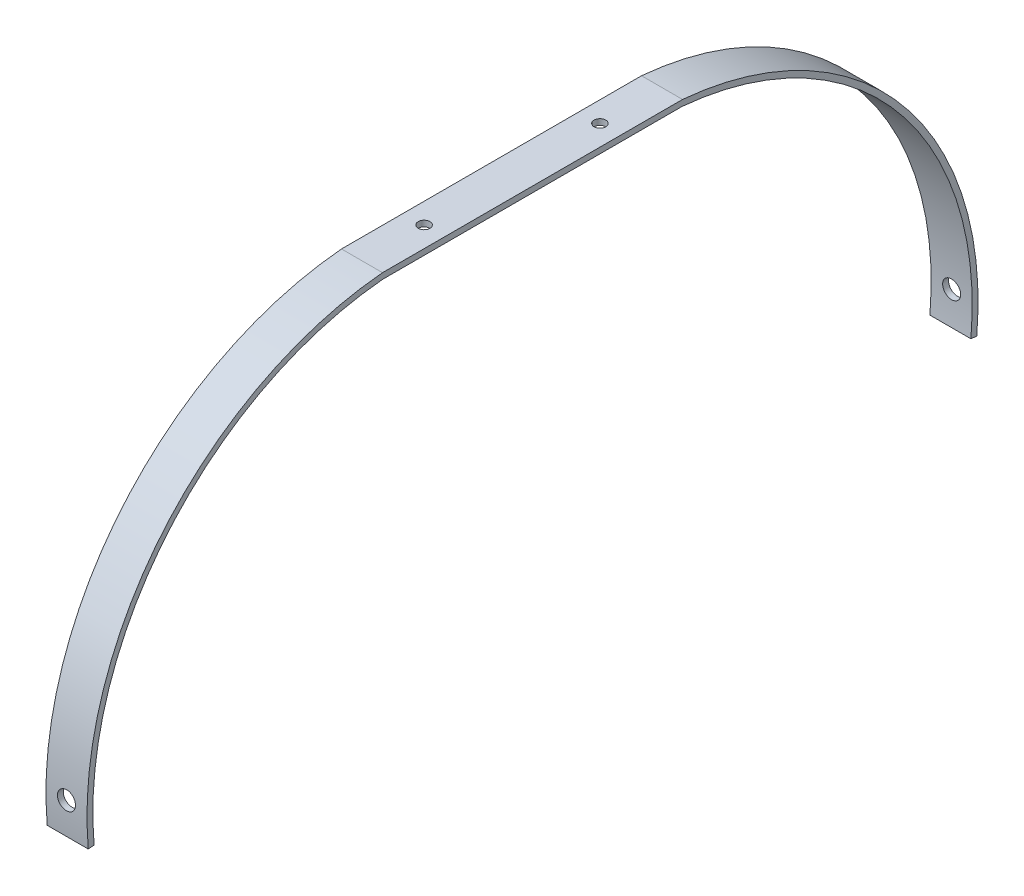
ISO-10303-21;
HEADER;
FILE_DESCRIPTION(('STEP AP214'),'2;1');
FILE_NAME('part.step','',(''),(''),'','','');
FILE_SCHEMA(('AUTOMOTIVE_DESIGN { 1 0 10303 214 1 1 1 1 }'));
ENDSEC;
DATA;
#1=APPLICATION_CONTEXT('core data for automotive mechanical design processes');
#2=APPLICATION_PROTOCOL_DEFINITION('international standard','automotive_design',2000,#1);
#3=PRODUCT_CONTEXT('',#1,'mechanical');
#4=PRODUCT('Part','Part','',(#3));
#5=PRODUCT_RELATED_PRODUCT_CATEGORY('part','',(#4));
#6=PRODUCT_DEFINITION_FORMATION('','',#4);
#7=PRODUCT_DEFINITION_CONTEXT('part definition',#1,'design');
#8=PRODUCT_DEFINITION('design','',#6,#7);
#9=PRODUCT_DEFINITION_SHAPE('','',#8);
#10=(LENGTH_UNIT() NAMED_UNIT(*) SI_UNIT(.MILLI.,.METRE.));
#11=(NAMED_UNIT(*) PLANE_ANGLE_UNIT() SI_UNIT($,.RADIAN.));
#12=(NAMED_UNIT(*) SI_UNIT($,.STERADIAN.) SOLID_ANGLE_UNIT());
#13=UNCERTAINTY_MEASURE_WITH_UNIT(LENGTH_MEASURE(1.E-05),#10,'distance_accuracy_value','');
#14=(GEOMETRIC_REPRESENTATION_CONTEXT(3) GLOBAL_UNCERTAINTY_ASSIGNED_CONTEXT((#13)) GLOBAL_UNIT_ASSIGNED_CONTEXT((#10,
#11,#12)) REPRESENTATION_CONTEXT('',''));
#15=CARTESIAN_POINT('',(0.,0.,0.));
#16=DIRECTION('',(0.,0.,1.));
#17=DIRECTION('',(1.,0.,0.));
#18=AXIS2_PLACEMENT_3D('',#15,#16,#17);
#19=CARTESIAN_POINT('',(17.78,-138.75,52.48));
#20=DIRECTION('',(-1.,0.,0.));
#21=DIRECTION('',(0.,0.,1.));
#22=AXIS2_PLACEMENT_3D('',#19,#20,#21);
#23=CYLINDRICAL_SURFACE('',#22,138.03862853222);
#24=CARTESIAN_POINT('',(12.804165929384,-137.16,190.509471009116));
#25=CARTESIAN_POINT('',(12.8041562065637,-137.379778837389,190.512001955785));
#26=CARTESIAN_POINT('',(12.7855931168543,-137.599721736816,190.514005669718));
#27=CARTESIAN_POINT('',(12.7117945241355,-138.033559604602,190.516940338744));
#28=CARTESIAN_POINT('',(12.6565153214002,-138.247447049059,190.517870011891));
#29=CARTESIAN_POINT('',(12.5108567516558,-138.662825827877,190.518757195393));
#30=CARTESIAN_POINT('',(12.4204941428394,-138.8643230275,190.518715169337));
#31=CARTESIAN_POINT('',(12.2072563901937,-139.249236294209,190.517860101291));
#32=CARTESIAN_POINT('',(12.084389193013,-139.43265676563,190.517047247626));
#33=CARTESIAN_POINT('',(11.8095901146757,-139.776314160567,190.514920338043));
#34=CARTESIAN_POINT('',(11.6576521405216,-139.936546211592,190.513606176998));
#35=CARTESIAN_POINT('',(11.3290323743908,-140.229239967642,190.510780248229));
#36=CARTESIAN_POINT('',(11.1523495962043,-140.361700565304,190.50926847263));
#37=CARTESIAN_POINT('',(10.7792170207906,-140.595111494538,190.506346066599));
#38=CARTESIAN_POINT('',(10.5827630583147,-140.696055167903,190.504935457587));
#39=CARTESIAN_POINT('',(10.1756949159369,-140.863528230789,190.502472881831));
#40=CARTESIAN_POINT('',(9.96508076878997,-140.930057699913,190.501420914257));
#41=CARTESIAN_POINT('',(9.53567607933015,-141.026811787035,190.499858938232));
#42=CARTESIAN_POINT('',(9.31688575389829,-141.057037367325,190.499348915416));
#43=CARTESIAN_POINT('',(8.87733599243423,-141.080327920025,190.498957686211));
#44=CARTESIAN_POINT('',(8.65657656142105,-141.073392987127,190.499076478219));
#45=CARTESIAN_POINT('',(8.21938273618705,-141.022562909102,190.499922682459));
#46=CARTESIAN_POINT('',(8.00294782779847,-140.978672184957,190.500650021891));
#47=CARTESIAN_POINT('',(7.58051848156696,-140.855182979798,190.502588561675));
#48=CARTESIAN_POINT('',(7.37452406200668,-140.775584436257,190.503799762874));
#49=CARTESIAN_POINT('',(6.97880821800266,-140.582933023265,190.50649223341));
#50=CARTESIAN_POINT('',(6.78908785364217,-140.469877976607,190.507973520322));
#51=CARTESIAN_POINT('',(6.43131798003344,-140.213523686767,190.510929292327));
#52=CARTESIAN_POINT('',(6.26326848077982,-140.070224429637,190.512403777418));
#53=CARTESIAN_POINT('',(5.95359249036027,-139.757430591976,190.515040681927));
#54=CARTESIAN_POINT('',(5.8119687889564,-139.587933249173,190.516203068403));
#55=CARTESIAN_POINT('',(5.55918764780873,-139.227564929337,190.517919827591));
#56=CARTESIAN_POINT('',(5.44803017639788,-139.036693974521,190.518474200935));
#57=CARTESIAN_POINT('',(5.25935271355084,-138.639027543524,190.51872694068));
#58=CARTESIAN_POINT('',(5.18182776938136,-138.432234417331,190.518425433168));
#59=CARTESIAN_POINT('',(5.06259280947383,-138.008572617414,190.516799783607));
#60=CARTESIAN_POINT('',(5.02088272271768,-137.79170396367,190.515475643587));
#61=CARTESIAN_POINT('',(4.97446428360646,-137.354103193993,190.511743787287));
#62=CARTESIAN_POINT('',(4.96974726153675,-137.133371995441,190.509336325036));
#63=CARTESIAN_POINT('',(4.99742000042755,-136.694261983716,190.503494843265));
#64=CARTESIAN_POINT('',(5.02980979095735,-136.475883172418,190.500060822928));
#65=CARTESIAN_POINT('',(5.13077706248227,-136.047641669385,190.492340469444));
#66=CARTESIAN_POINT('',(5.19935962476699,-135.837780177897,190.488054016672));
#67=CARTESIAN_POINT('',(5.37076441846223,-135.432552892915,190.478908066149));
#68=CARTESIAN_POINT('',(5.47358676442857,-135.237187147923,190.47404856648));
#69=CARTESIAN_POINT('',(5.71061277148048,-134.866393050816,190.464111515815));
#70=CARTESIAN_POINT('',(5.84483182392033,-134.690974540156,190.459033858873));
#71=CARTESIAN_POINT('',(6.14081913576395,-134.365158165735,190.449064473726));
#72=CARTESIAN_POINT('',(6.30258745359432,-134.21476035504,190.444172745915));
#73=CARTESIAN_POINT('',(6.64912387978107,-133.943226317767,190.434979643409));
#74=CARTESIAN_POINT('',(6.8338964850176,-133.822095826019,190.430678384487));
#75=CARTESIAN_POINT('',(7.22117550255614,-133.61257985386,190.423035053519));
#76=CARTESIAN_POINT('',(7.42368184264433,-133.524194240115,190.419692977569));
#77=CARTESIAN_POINT('',(7.84057563117651,-133.382721432518,190.414260908303));
#78=CARTESIAN_POINT('',(8.05495720473448,-133.329616950481,190.412170301801));
#79=CARTESIAN_POINT('',(8.48960201123869,-133.260152408705,190.409423138942));
#80=CARTESIAN_POINT('',(8.70986522875954,-133.243792252608,190.408766578824));
#81=CARTESIAN_POINT('',(9.14986678811167,-133.24828193548,190.408945725086));
#82=CARTESIAN_POINT('',(9.36960537899232,-133.269107447561,190.409780455862));
#83=CARTESIAN_POINT('',(9.80246437928202,-133.347327048135,190.412866291034));
#84=CARTESIAN_POINT('',(10.0155847777466,-133.4047211971,190.415117397772));
#85=CARTESIAN_POINT('',(10.4291645658046,-133.554443889178,190.420837820413));
#86=CARTESIAN_POINT('',(10.6296237631951,-133.64677296247,190.424307154805));
#87=CARTESIAN_POINT('',(11.0121923382072,-133.863736888478,190.432162476238));
#88=CARTESIAN_POINT('',(11.1943023552549,-133.98837061491,190.43654843132));
#89=CARTESIAN_POINT('',(11.5351215201947,-134.266484456134,190.445866684622));
#90=CARTESIAN_POINT('',(11.6938178548575,-134.419980262079,190.450799279425));
#91=CARTESIAN_POINT('',(11.9832350866285,-134.751471758587,190.46080364535));
#92=CARTESIAN_POINT('',(12.1139489877694,-134.929473557727,190.465875450921));
#93=CARTESIAN_POINT('',(12.3437552696411,-135.305058827823,190.475763156718));
#94=CARTESIAN_POINT('',(12.442816884766,-135.502661107256,190.480578804197));
#95=CARTESIAN_POINT('',(12.6062401222461,-135.911553265103,190.489593258251));
#96=CARTESIAN_POINT('',(12.6706430986031,-136.12282649275,190.493792795582));
#97=CARTESIAN_POINT('',(12.7458592887294,-136.472860985372,190.499911417307));
#98=CARTESIAN_POINT('',(12.7676963959981,-136.609347255174,190.502097555673));
#99=CARTESIAN_POINT('',(12.7968527704833,-136.883867424663,190.50608218769));
#100=CARTESIAN_POINT('',(12.8041720387466,-137.021901324237,190.507880681368));
#101=CARTESIAN_POINT('',(12.804165929384,-137.16,190.509471009116));
#102=B_SPLINE_CURVE_WITH_KNOTS('',3,(#24,#25,#26,#27,#28,#29,#30,#31,#32,#33,#34,#35,#36,#37,
#38,#39,#40,#41,#42,#43,#44,#45,#46,#47,#48,#49,#50,#51,#52,#53,#54,#55,#56,#57,#58,#59,#60,#61,
#62,#63,#64,#65,#66,#67,#68,#69,#70,#71,#72,#73,#74,#75,#76,#77,#78,#79,#80,#81,#82,#83,#84,#85,
#86,#87,#88,#89,#90,#91,#92,#93,#94,#95,#96,#97,#98,#99,#100,#101),.UNSPECIFIED.,.T.,.F.,(4,2,2,
2,2,2,2,2,2,2,2,2,2,2,2,2,2,2,2,2,2,2,2,2,2,2,2,2,2,2,2,2,2,2,2,2,2,2,4),(0.,0.658876303413915,
1.31853821376157,1.97788541214516,2.63707156353566,3.29639602660568,3.95574677468526,
4.61523672190497,5.27472514365692,5.93419608423841,6.59366534438694,7.2530557241175,
7.91244725848575,8.57188171269995,9.23131647104483,9.89082080634323,10.5503244561408,
11.2097309542938,11.8691361448917,12.528386792313,13.1876379650718,13.8469817181306,
14.5063276771736,15.1659975419634,15.8256688058011,16.4854692253045,17.145266958149,
17.8047411431561,18.4642135987745,19.1232547851284,19.782297061278,20.4413493395868,
21.1003786435116,21.7597672765886,22.419320573243,23.0795130105071,23.7389159627899,
24.1529228464133,24.566929700185),.UNSPECIFIED.);
#103=CARTESIAN_POINT('',(12.804165929384,-137.16,190.509471009116));
#104=VERTEX_POINT('',#103);
#105=EDGE_CURVE('E148',#104,#104,#102,.T.);
#106=ORIENTED_EDGE('',*,*,#105,.F.);
#107=EDGE_LOOP('',(#106));
#108=FACE_BOUND('',#107,.T.);
#109=CARTESIAN_POINT('',(0.,-138.75,52.48));
#110=DIRECTION('',(1.,0.,0.));
#111=DIRECTION('',(0.,0.,-1.));
#112=AXIS2_PLACEMENT_3D('',#109,#110,#111);
#113=CIRCLE('',#112,138.03862853222);
#114=CARTESIAN_POINT('',(0.,-1.27,64.8861503721467));
#115=VERTEX_POINT('',#114);
#116=CARTESIAN_POINT('',(0.,-151.043786383236,189.970093401014));
#117=VERTEX_POINT('',#116);
#118=EDGE_CURVE('E145',#115,#117,#113,.T.);
#119=ORIENTED_EDGE('',*,*,#118,.F.);
#120=DIRECTION('',(-1.,0.,0.));
#121=VECTOR('',#120,1.);
#122=CARTESIAN_POINT('',(17.78,-1.27,64.8861503721467));
#123=LINE('',#122,#121);
#124=CARTESIAN_POINT('',(17.78,-1.27,64.8861503721467));
#125=VERTEX_POINT('',#124);
#126=EDGE_CURVE('E57',#125,#115,#123,.T.);
#127=ORIENTED_EDGE('',*,*,#126,.F.);
#128=CARTESIAN_POINT('',(17.78,-138.75,52.48));
#129=DIRECTION('',(1.,0.,0.));
#130=DIRECTION('',(0.,0.,-1.));
#131=AXIS2_PLACEMENT_3D('',#128,#129,#130);
#132=CIRCLE('',#131,138.03862853222);
#133=CARTESIAN_POINT('',(17.78,-151.043786383236,189.970093401014));
#134=VERTEX_POINT('',#133);
#135=EDGE_CURVE('E164',#125,#134,#132,.T.);
#136=ORIENTED_EDGE('',*,*,#135,.T.);
#137=DIRECTION('',(-1.,0.,0.));
#138=VECTOR('',#137,1.);
#139=CARTESIAN_POINT('',(17.78,-151.043786383236,189.970093401014));
#140=LINE('',#139,#138);
#141=EDGE_CURVE('E65',#134,#117,#140,.T.);
#142=ORIENTED_EDGE('',*,*,#141,.T.);
#143=EDGE_LOOP('',(#119,#127,#136,#142));
#144=FACE_BOUND('',#143,.T.);
#145=ADVANCED_FACE('F43',(#108,#144),#23,.F.);
#146=CARTESIAN_POINT('',(17.78,-1.27,0.));
#147=DIRECTION('',(0.,1.,0.));
#148=DIRECTION('',(0.,0.,1.));
#149=AXIS2_PLACEMENT_3D('',#146,#147,#148);
#150=PLANE('',#149);
#151=CARTESIAN_POINT('',(8.89,-1.27,-38.1));
#152=DIRECTION('',(0.,1.,0.));
#153=DIRECTION('',(0.,0.,1.));
#154=AXIS2_PLACEMENT_3D('',#151,#152,#153);
#155=CIRCLE('',#154,2.54);
#156=CARTESIAN_POINT('',(8.89,-1.27,-35.56));
#157=VERTEX_POINT('',#156);
#158=EDGE_CURVE('E230',#157,#157,#155,.T.);
#159=ORIENTED_EDGE('',*,*,#158,.T.);
#160=EDGE_LOOP('',(#159));
#161=FACE_BOUND('',#160,.T.);
#162=CARTESIAN_POINT('',(8.89000000000001,-1.27,38.1));
#163=DIRECTION('',(0.,1.,0.));
#164=DIRECTION('',(0.,0.,1.));
#165=AXIS2_PLACEMENT_3D('',#162,#163,#164);
#166=CIRCLE('',#165,2.54);
#167=CARTESIAN_POINT('',(8.89000000000001,-1.27,40.64));
#168=VERTEX_POINT('',#167);
#169=EDGE_CURVE('E398',#168,#168,#166,.T.);
#170=ORIENTED_EDGE('',*,*,#169,.T.);
#171=EDGE_LOOP('',(#170));
#172=FACE_BOUND('',#171,.T.);
#173=DIRECTION('',(0.,0.,-1.));
#174=VECTOR('',#173,1.);
#175=CARTESIAN_POINT('',(0.,-1.27,0.));
#176=LINE('',#175,#174);
#177=CARTESIAN_POINT('',(0.,-1.27,-64.8861503721467));
#178=VERTEX_POINT('',#177);
#179=EDGE_CURVE('E147',#115,#178,#176,.T.);
#180=ORIENTED_EDGE('',*,*,#179,.T.);
#181=DIRECTION('',(-1.,0.,0.));
#182=VECTOR('',#181,1.);
#183=CARTESIAN_POINT('',(17.78,-1.27,-64.8861503721467));
#184=LINE('',#183,#182);
#185=CARTESIAN_POINT('',(17.78,-1.27,-64.8861503721467));
#186=VERTEX_POINT('',#185);
#187=EDGE_CURVE('E173',#186,#178,#184,.T.);
#188=ORIENTED_EDGE('',*,*,#187,.F.);
#189=DIRECTION('',(0.,0.,-1.));
#190=VECTOR('',#189,1.);
#191=CARTESIAN_POINT('',(17.78,-1.27,0.));
#192=LINE('',#191,#190);
#193=EDGE_CURVE('E179',#125,#186,#192,.T.);
#194=ORIENTED_EDGE('',*,*,#193,.F.);
#195=ORIENTED_EDGE('',*,*,#126,.T.);
#196=EDGE_LOOP('',(#180,#188,#194,#195));
#197=FACE_BOUND('',#196,.T.);
#198=ADVANCED_FACE('F177',(#161,#172,#197),#150,.F.);
#199=CARTESIAN_POINT('',(17.78,-138.75,-52.48));
#200=DIRECTION('',(-1.,0.,0.));
#201=DIRECTION('',(0.,0.,1.));
#202=AXIS2_PLACEMENT_3D('',#199,#200,#201);
#203=CYLINDRICAL_SURFACE('',#202,138.03862853222);
#204=CARTESIAN_POINT('',(12.804165929384,-137.16,-190.509471009116));
#205=CARTESIAN_POINT('',(12.8041562065637,-137.379778837389,-190.512001955785));
#206=CARTESIAN_POINT('',(12.7855931168543,-137.599721736816,-190.514005669718));
#207=CARTESIAN_POINT('',(12.7117945241355,-138.033559604602,-190.516940338744));
#208=CARTESIAN_POINT('',(12.6565153214002,-138.247447049059,-190.517870011891));
#209=CARTESIAN_POINT('',(12.5108567516558,-138.662825827877,-190.518757195393));
#210=CARTESIAN_POINT('',(12.4204941428394,-138.8643230275,-190.518715169337));
#211=CARTESIAN_POINT('',(12.2072563901937,-139.249236294209,-190.517860101291));
#212=CARTESIAN_POINT('',(12.084389193013,-139.43265676563,-190.517047247626));
#213=CARTESIAN_POINT('',(11.8095901146757,-139.776314160567,-190.514920338043));
#214=CARTESIAN_POINT('',(11.6576521405216,-139.936546211592,-190.513606176998));
#215=CARTESIAN_POINT('',(11.3290323743908,-140.229239967642,-190.510780248229));
#216=CARTESIAN_POINT('',(11.1523495962043,-140.361700565304,-190.50926847263));
#217=CARTESIAN_POINT('',(10.7792170207906,-140.595111494538,-190.506346066599));
#218=CARTESIAN_POINT('',(10.5827630583147,-140.696055167903,-190.504935457587));
#219=CARTESIAN_POINT('',(10.1756949159369,-140.863528230789,-190.502472881831));
#220=CARTESIAN_POINT('',(9.96508076878997,-140.930057699913,-190.501420914257));
#221=CARTESIAN_POINT('',(9.53567607933015,-141.026811787035,-190.499858938232));
#222=CARTESIAN_POINT('',(9.31688575389829,-141.057037367325,-190.499348915416));
#223=CARTESIAN_POINT('',(8.87733599243423,-141.080327920025,-190.498957686211));
#224=CARTESIAN_POINT('',(8.65657656142105,-141.073392987127,-190.499076478219));
#225=CARTESIAN_POINT('',(8.21938273618705,-141.022562909102,-190.499922682459));
#226=CARTESIAN_POINT('',(8.00294782779847,-140.978672184957,-190.500650021891));
#227=CARTESIAN_POINT('',(7.58051848156696,-140.855182979798,-190.502588561675));
#228=CARTESIAN_POINT('',(7.37452406200668,-140.775584436257,-190.503799762874));
#229=CARTESIAN_POINT('',(6.97880821800266,-140.582933023265,-190.50649223341));
#230=CARTESIAN_POINT('',(6.78908785364217,-140.469877976607,-190.507973520322));
#231=CARTESIAN_POINT('',(6.43131798003344,-140.213523686767,-190.510929292327));
#232=CARTESIAN_POINT('',(6.26326848077982,-140.070224429637,-190.512403777418));
#233=CARTESIAN_POINT('',(5.95359249036027,-139.757430591976,-190.515040681927));
#234=CARTESIAN_POINT('',(5.8119687889564,-139.587933249173,-190.516203068403));
#235=CARTESIAN_POINT('',(5.55918764780873,-139.227564929337,-190.517919827591));
#236=CARTESIAN_POINT('',(5.44803017639788,-139.036693974521,-190.518474200935));
#237=CARTESIAN_POINT('',(5.25935271355084,-138.639027543524,-190.51872694068));
#238=CARTESIAN_POINT('',(5.18182776938136,-138.432234417331,-190.518425433168));
#239=CARTESIAN_POINT('',(5.06259280947383,-138.008572617414,-190.516799783607));
#240=CARTESIAN_POINT('',(5.02088272271768,-137.79170396367,-190.515475643587));
#241=CARTESIAN_POINT('',(4.97446428360646,-137.354103193993,-190.511743787287));
#242=CARTESIAN_POINT('',(4.96974726153675,-137.133371995441,-190.509336325036));
#243=CARTESIAN_POINT('',(4.99742000042755,-136.694261983716,-190.503494843265));
#244=CARTESIAN_POINT('',(5.02980979095735,-136.475883172418,-190.500060822928));
#245=CARTESIAN_POINT('',(5.13077706248227,-136.047641669385,-190.492340469444));
#246=CARTESIAN_POINT('',(5.19935962476699,-135.837780177897,-190.488054016672));
#247=CARTESIAN_POINT('',(5.37076441846224,-135.432552892915,-190.478908066149));
#248=CARTESIAN_POINT('',(5.47358676442858,-135.237187147923,-190.47404856648));
#249=CARTESIAN_POINT('',(5.71061277148049,-134.866393050816,-190.464111515815));
#250=CARTESIAN_POINT('',(5.84483182392034,-134.690974540156,-190.459033858873));
#251=CARTESIAN_POINT('',(6.14081913576396,-134.365158165735,-190.449064473726));
#252=CARTESIAN_POINT('',(6.30258745359432,-134.21476035504,-190.444172745915));
#253=CARTESIAN_POINT('',(6.64912387978107,-133.943226317767,-190.434979643409));
#254=CARTESIAN_POINT('',(6.83389648501759,-133.822095826019,-190.430678384487));
#255=CARTESIAN_POINT('',(7.22117550255613,-133.61257985386,-190.423035053519));
#256=CARTESIAN_POINT('',(7.42368184264433,-133.524194240115,-190.419692977569));
#257=CARTESIAN_POINT('',(7.84057563117651,-133.382721432518,-190.414260908303));
#258=CARTESIAN_POINT('',(8.05495720473448,-133.329616950481,-190.412170301801));
#259=CARTESIAN_POINT('',(8.48960201123869,-133.260152408705,-190.409423138942));
#260=CARTESIAN_POINT('',(8.70986522875954,-133.243792252608,-190.408766578824));
#261=CARTESIAN_POINT('',(9.14986678811167,-133.24828193548,-190.408945725086));
#262=CARTESIAN_POINT('',(9.36960537899231,-133.269107447561,-190.409780455862));
#263=CARTESIAN_POINT('',(9.80246437928202,-133.347327048135,-190.412866291034));
#264=CARTESIAN_POINT('',(10.0155847777466,-133.4047211971,-190.415117397772));
#265=CARTESIAN_POINT('',(10.4291645658046,-133.554443889178,-190.420837820413));
#266=CARTESIAN_POINT('',(10.6296237631951,-133.64677296247,-190.424307154805));
#267=CARTESIAN_POINT('',(11.0121923382072,-133.863736888478,-190.432162476238));
#268=CARTESIAN_POINT('',(11.1943023552549,-133.98837061491,-190.43654843132));
#269=CARTESIAN_POINT('',(11.5351215201947,-134.266484456134,-190.445866684622));
#270=CARTESIAN_POINT('',(11.6938178548575,-134.419980262079,-190.450799279425));
#271=CARTESIAN_POINT('',(11.9832350866285,-134.751471758587,-190.46080364535));
#272=CARTESIAN_POINT('',(12.1139489877694,-134.929473557727,-190.465875450921));
#273=CARTESIAN_POINT('',(12.3437552696411,-135.305058827823,-190.475763156718));
#274=CARTESIAN_POINT('',(12.442816884766,-135.502661107256,-190.480578804197));
#275=CARTESIAN_POINT('',(12.6062401222461,-135.911553265103,-190.489593258251));
#276=CARTESIAN_POINT('',(12.6706430986031,-136.12282649275,-190.493792795582));
#277=CARTESIAN_POINT('',(12.7458592887294,-136.472860985372,-190.499911417307));
#278=CARTESIAN_POINT('',(12.7676963959981,-136.609347255174,-190.502097555673));
#279=CARTESIAN_POINT('',(12.7968527704833,-136.883867424663,-190.50608218769));
#280=CARTESIAN_POINT('',(12.8041720387466,-137.021901324237,-190.507880681368));
#281=CARTESIAN_POINT('',(12.804165929384,-137.16,-190.509471009116));
#282=B_SPLINE_CURVE_WITH_KNOTS('',3,(#204,#205,#206,#207,#208,#209,#210,#211,#212,#213,#214,
#215,#216,#217,#218,#219,#220,#221,#222,#223,#224,#225,#226,#227,#228,#229,#230,#231,#232,#233,
#234,#235,#236,#237,#238,#239,#240,#241,#242,#243,#244,#245,#246,#247,#248,#249,#250,#251,#252,
#253,#254,#255,#256,#257,#258,#259,#260,#261,#262,#263,#264,#265,#266,#267,#268,#269,#270,#271,
#272,#273,#274,#275,#276,#277,#278,#279,#280,#281),.UNSPECIFIED.,.T.,.F.,(4,2,2,2,2,2,2,2,2,2,2,
2,2,2,2,2,2,2,2,2,2,2,2,2,2,2,2,2,2,2,2,2,2,2,2,2,2,2,4),(0.,0.658876303413915,1.31853821376157,
1.97788541214516,2.63707156353566,3.29639602660568,3.95574677468526,4.61523672190497,
5.27472514365692,5.93419608423841,6.59366534438694,7.2530557241175,7.91244725848574,
8.57188171269995,9.23131647104483,9.89082080634323,10.5503244561408,11.2097309542938,
11.8691361448917,12.528386792313,13.1876379650718,13.8469817181306,14.5063276771736,
15.1659975419634,15.8256688058011,16.4854692253045,17.145266958149,17.8047411431561,
18.4642135987745,19.1232547851285,19.7822970612781,20.4413493395868,21.1003786435116,
21.7597672765886,22.4193205732431,23.0795130105071,23.7389159627899,24.1529228464133,
24.566929700185),.UNSPECIFIED.);
#283=CARTESIAN_POINT('',(12.804165929384,-137.16,-190.509471009116));
#284=VERTEX_POINT('',#283);
#285=EDGE_CURVE('E196',#284,#284,#282,.T.);
#286=ORIENTED_EDGE('',*,*,#285,.T.);
#287=EDGE_LOOP('',(#286));
#288=FACE_BOUND('',#287,.T.);
#289=CARTESIAN_POINT('',(0.,-138.75,-52.48));
#290=DIRECTION('',(1.,0.,0.));
#291=DIRECTION('',(0.,0.,-1.));
#292=AXIS2_PLACEMENT_3D('',#289,#290,#291);
#293=CIRCLE('',#292,138.03862853222);
#294=CARTESIAN_POINT('',(0.,-151.043786383236,-189.970093401014));
#295=VERTEX_POINT('',#294);
#296=EDGE_CURVE('E150',#178,#295,#293,.F.);
#297=ORIENTED_EDGE('',*,*,#296,.T.);
#298=DIRECTION('',(-1.,0.,0.));
#299=VECTOR('',#298,1.);
#300=CARTESIAN_POINT('',(17.78,-151.043786383236,-189.970093401014));
#301=LINE('',#300,#299);
#302=CARTESIAN_POINT('',(17.78,-151.043786383236,-189.970093401014));
#303=VERTEX_POINT('',#302);
#304=EDGE_CURVE('E170',#303,#295,#301,.T.);
#305=ORIENTED_EDGE('',*,*,#304,.F.);
#306=CARTESIAN_POINT('',(17.78,-138.75,-52.48));
#307=DIRECTION('',(1.,0.,0.));
#308=DIRECTION('',(0.,0.,-1.));
#309=AXIS2_PLACEMENT_3D('',#306,#307,#308);
#310=CIRCLE('',#309,138.03862853222);
#311=EDGE_CURVE('E407',#186,#303,#310,.F.);
#312=ORIENTED_EDGE('',*,*,#311,.F.);
#313=ORIENTED_EDGE('',*,*,#187,.T.);
#314=EDGE_LOOP('',(#297,#305,#312,#313));
#315=FACE_BOUND('',#314,.T.);
#316=ADVANCED_FACE('F191',(#288,#315),#203,.F.);
#317=CARTESIAN_POINT('',(17.78,-132.994146147226,11.891777672929));
#318=DIRECTION('',(0.,0.996026220073043,-0.0890604790409684));
#319=DIRECTION('',(0.,0.0890604790409684,0.996026220073043));
#320=AXIS2_PLACEMENT_3D('',#317,#318,#319);
#321=PLANE('',#320);
#322=DIRECTION('',(0.,-0.0890604790409684,-0.996026220073043));
#323=VECTOR('',#322,1.);
#324=CARTESIAN_POINT('',(0.,-132.994146147226,11.891777672929));
#325=LINE('',#324,#323);
#326=CARTESIAN_POINT('',(0.,-151.27,-192.5));
#327=VERTEX_POINT('',#326);
#328=EDGE_CURVE('E152',#295,#327,#325,.T.);
#329=ORIENTED_EDGE('',*,*,#328,.T.);
#330=DIRECTION('',(-1.,0.,0.));
#331=VECTOR('',#330,1.);
#332=CARTESIAN_POINT('',(17.78,-151.27,-192.5));
#333=LINE('',#332,#331);
#334=CARTESIAN_POINT('',(17.78,-151.27,-192.5));
#335=VERTEX_POINT('',#334);
#336=EDGE_CURVE('E168',#335,#327,#333,.T.);
#337=ORIENTED_EDGE('',*,*,#336,.F.);
#338=DIRECTION('',(0.,-0.0890604790409684,-0.996026220073043));
#339=VECTOR('',#338,1.);
#340=CARTESIAN_POINT('',(17.78,-132.994146147226,11.891777672929));
#341=LINE('',#340,#339);
#342=EDGE_CURVE('E140',#303,#335,#341,.T.);
#343=ORIENTED_EDGE('',*,*,#342,.F.);
#344=ORIENTED_EDGE('',*,*,#304,.T.);
#345=EDGE_LOOP('',(#329,#337,#343,#344));
#346=FACE_BOUND('',#345,.T.);
#347=ADVANCED_FACE('F237',(#346),#321,.F.);
#348=CARTESIAN_POINT('',(17.78,-138.75,-52.48));
#349=DIRECTION('',(-1.,0.,0.));
#350=DIRECTION('',(0.,0.,1.));
#351=AXIS2_PLACEMENT_3D('',#348,#349,#350);
#352=CYLINDRICAL_SURFACE('',#351,140.57862853222);
#353=CARTESIAN_POINT('',(5.31332627672714,-138.75,-193.05862853222));
#354=CARTESIAN_POINT('',(5.2240501745839,-138.549151221131,-193.058627894012));
#355=CARTESIAN_POINT('',(5.15166616473986,-138.340620032318,-193.058193828373));
#356=CARTESIAN_POINT('',(5.04287017560827,-137.914198034444,-193.056305908208));
#357=CARTESIAN_POINT('',(5.00650122728152,-137.696296352885,-193.054850837317));
#358=CARTESIAN_POINT('',(4.97087179108953,-137.257574224166,-193.050877255792));
#359=CARTESIAN_POINT('',(4.9715935671957,-137.03675522251,-193.048359254002));
#360=CARTESIAN_POINT('',(5.01008433002828,-136.598444024498,-193.042333689926));
#361=CARTESIAN_POINT('',(5.04784424644755,-136.380951026877,-193.038826370065));
#362=CARTESIAN_POINT('',(5.15932951513274,-135.955344747357,-193.031008674325));
#363=CARTESIAN_POINT('',(5.23306357193454,-135.747233748907,-193.026698104242));
#364=CARTESIAN_POINT('',(5.41440912331613,-135.346338824637,-193.017561305017));
#365=CARTESIAN_POINT('',(5.52202204300134,-135.153555544002,-193.012735054188));
#366=CARTESIAN_POINT('',(5.76812872408744,-134.788701129243,-193.002924408245));
#367=CARTESIAN_POINT('',(5.90663664010224,-134.616639544633,-192.997939941545));
#368=CARTESIAN_POINT('',(6.2105786799456,-134.298210192932,-192.988212569216));
#369=CARTESIAN_POINT('',(6.37601278816778,-134.151842410949,-192.983469663446));
#370=CARTESIAN_POINT('',(6.72914511446502,-133.888935419337,-192.974619860238));
#371=CARTESIAN_POINT('',(6.91684656184114,-133.772400543956,-192.970513055249));
#372=CARTESIAN_POINT('',(7.30916927111815,-133.572502594248,-192.963288584313));
#373=CARTESIAN_POINT('',(7.51379044860441,-133.489139354436,-192.960170913433));
#374=CARTESIAN_POINT('',(7.93403400706899,-133.357993930971,-192.955198550701));
#375=CARTESIAN_POINT('',(8.14965071873571,-133.310193605322,-192.953343214927));
#376=CARTESIAN_POINT('',(8.58585598705091,-133.251468077141,-192.951056898201));
#377=CARTESIAN_POINT('',(8.80644452839897,-133.240542761144,-192.950625912866));
#378=CARTESIAN_POINT('',(9.24618928039061,-133.25587426718,-192.951226365841));
#379=CARTESIAN_POINT('',(9.46534627736039,-133.282108581847,-192.952256918907));
#380=CARTESIAN_POINT('',(9.89614186153677,-133.370970591802,-192.955687563089));
#381=CARTESIAN_POINT('',(10.1077804511337,-133.433598275519,-192.95808765377));
#382=CARTESIAN_POINT('',(10.5175485473888,-133.593467981374,-192.964046554397));
#383=CARTESIAN_POINT('',(10.7156772968961,-133.690711941662,-192.967605429221));
#384=CARTESIAN_POINT('',(11.0928013550077,-133.917050023065,-192.975573474262));
#385=CARTESIAN_POINT('',(11.2717965844484,-134.046144275951,-192.979982647996));
#386=CARTESIAN_POINT('',(11.6056963407097,-134.332614642514,-192.989280831104));
#387=CARTESIAN_POINT('',(11.7605852510638,-134.490008948327,-192.994170148205));
#388=CARTESIAN_POINT('',(12.041746477336,-134.8285612317,-193.004025487424));
#389=CARTESIAN_POINT('',(12.1680187140116,-135.009719275062,-193.008991509755));
#390=CARTESIAN_POINT('',(12.3884152614369,-135.39074985042,-193.018615768857));
#391=CARTESIAN_POINT('',(12.4825255424624,-135.590630501297,-193.023273870594));
#392=CARTESIAN_POINT('',(12.6358465595452,-136.00336975852,-193.031945525037));
#393=CARTESIAN_POINT('',(12.6950573415632,-136.216228347775,-193.03595907859));
#394=CARTESIAN_POINT('',(12.7768820021822,-136.648832194495,-193.043091389775));
#395=CARTESIAN_POINT('',(12.7995041316315,-136.868575887954,-193.046210349009));
#396=CARTESIAN_POINT('',(12.8075275460185,-137.308753834593,-193.051412644121));
#397=CARTESIAN_POINT('',(12.7929289415469,-137.529188085721,-193.053495983077));
#398=CARTESIAN_POINT('',(12.7269364847678,-137.964380354512,-193.056601709223));
#399=CARTESIAN_POINT('',(12.6755597927668,-138.179140970999,-193.057624590668));
#400=CARTESIAN_POINT('',(12.5374867967426,-138.596993815446,-193.058700643462));
#401=CARTESIAN_POINT('',(12.4507904969049,-138.800086044788,-193.058753814927));
#402=CARTESIAN_POINT('',(12.2445503873208,-139.188815718198,-193.058078175791));
#403=CARTESIAN_POINT('',(12.1250099742355,-139.374454964551,-193.05734944603));
#404=CARTESIAN_POINT('',(11.8564705327249,-139.723035926366,-193.055369237038));
#405=CARTESIAN_POINT('',(11.7074714918522,-139.885977632239,-193.054117757586));
#406=CARTESIAN_POINT('',(11.3842037793915,-140.184577602387,-193.051388067804));
#407=CARTESIAN_POINT('',(11.2099292161727,-140.320229487859,-193.049909804608));
#408=CARTESIAN_POINT('',(10.8410808004945,-140.560353803933,-193.047022768579));
#409=CARTESIAN_POINT('',(10.6465068996045,-140.664826160143,-193.045613995911));
#410=CARTESIAN_POINT('',(10.2425560204388,-140.839636759999,-193.043124265996));
#411=CARTESIAN_POINT('',(10.033177245345,-140.909970852223,-193.042043348623));
#412=CARTESIAN_POINT('',(9.60558094411016,-141.014488213624,-193.040398590893));
#413=CARTESIAN_POINT('',(9.38736340802298,-141.048671442121,-193.039834751118));
#414=CARTESIAN_POINT('',(8.94830616087792,-141.07991428268,-193.039320402327));
#415=CARTESIAN_POINT('',(8.72746669102927,-141.076977283644,-193.039369837321));
#416=CARTESIAN_POINT('',(8.28942432923712,-141.034071707101,-193.040073508946));
#417=CARTESIAN_POINT('',(8.0722212955387,-140.994104576534,-193.040727721945));
#418=CARTESIAN_POINT('',(7.64764223235009,-140.878286926003,-193.042528862347));
#419=CARTESIAN_POINT('',(7.44026470115426,-140.802441909117,-193.043675714184));
#420=CARTESIAN_POINT('',(7.04113067937391,-140.616993790606,-193.046260834343));
#421=CARTESIAN_POINT('',(6.84937807188899,-140.507382329517,-193.047699174797));
#422=CARTESIAN_POINT('',(6.48689856453026,-140.257468514543,-193.050601220093));
#423=CARTESIAN_POINT('',(6.3161842647945,-140.117147906812,-193.052064939541));
#424=CARTESIAN_POINT('',(6.00090082393241,-139.809931596509,-193.054716094176));
#425=CARTESIAN_POINT('',(5.85630068732744,-139.643067847163,-193.055903857388));
#426=CARTESIAN_POINT('',(5.64550571049292,-139.353865696056,-193.057375912953));
#427=CARTESIAN_POINT('',(5.5701624963525,-139.238077091156,-193.0578319344));
#428=CARTESIAN_POINT('',(5.43210157338886,-138.999201983748,-193.058458444427));
#429=CARTESIAN_POINT('',(5.36938386663041,-138.876115480046,-193.058628932959));
#430=CARTESIAN_POINT('',(5.31332627672714,-138.75,-193.05862853222));
#431=B_SPLINE_CURVE_WITH_KNOTS('',3,(#353,#354,#355,#356,#357,#358,#359,#360,#361,#362,#363,
#364,#365,#366,#367,#368,#369,#370,#371,#372,#373,#374,#375,#376,#377,#378,#379,#380,#381,#382,
#383,#384,#385,#386,#387,#388,#389,#390,#391,#392,#393,#394,#395,#396,#397,#398,#399,#400,#401,
#402,#403,#404,#405,#406,#407,#408,#409,#410,#411,#412,#413,#414,#415,#416,#417,#418,#419,#420,
#421,#422,#423,#424,#425,#426,#427,#428,#429,#430),.UNSPECIFIED.,.T.,.F.,(4,2,2,2,2,2,2,2,2,2,2,
2,2,2,2,2,2,2,2,2,2,2,2,2,2,2,2,2,2,2,2,2,2,2,2,2,2,2,4),(0.,0.658885573497108,1.31855744007384,
1.97791386794345,2.63710886566238,3.29646344563424,3.95584576488937,4.61553080445437,
5.27521546166853,5.93499590628762,6.59477305937893,7.25421340383557,7.91365171919237,
8.57269078743998,9.23172964616001,9.89080541001127,10.5498839006342,11.209387591639,
11.8688931088561,12.5286859501803,13.1884779225948,13.8481210892361,14.5077622959424,
15.1670959207687,15.8264294674598,16.4856948530698,17.1449605172422,17.8043801015221,
18.4638012590948,19.1233025862324,19.7828046555155,20.4422465158105,21.1016626097204,
21.7609775928246,22.4204559320316,23.0803273421328,23.7394103136235,24.1531328031271,
24.5668553602904),.UNSPECIFIED.);
#432=CARTESIAN_POINT('',(5.31332627672714,-138.75,-193.05862853222));
#433=VERTEX_POINT('',#432);
#434=EDGE_CURVE('E199',#433,#433,#431,.T.);
#435=ORIENTED_EDGE('',*,*,#434,.F.);
#436=EDGE_LOOP('',(#435));
#437=FACE_BOUND('',#436,.T.);
#438=CARTESIAN_POINT('',(0.,-138.75,-52.48));
#439=DIRECTION('',(1.,0.,0.));
#440=DIRECTION('',(0.,0.,-1.));
#441=AXIS2_PLACEMENT_3D('',#438,#439,#440);
#442=CIRCLE('',#441,140.57862853222);
#443=CARTESIAN_POINT('',(0.,1.27,-65.));
#444=VERTEX_POINT('',#443);
#445=EDGE_CURVE('E155',#444,#327,#442,.F.);
#446=ORIENTED_EDGE('',*,*,#445,.F.);
#447=DIRECTION('',(-1.,0.,0.));
#448=VECTOR('',#447,1.);
#449=CARTESIAN_POINT('',(17.78,1.27,-65.));
#450=LINE('',#449,#448);
#451=CARTESIAN_POINT('',(17.78,1.27,-65.));
#452=VERTEX_POINT('',#451);
#453=EDGE_CURVE('E126',#452,#444,#450,.T.);
#454=ORIENTED_EDGE('',*,*,#453,.F.);
#455=CARTESIAN_POINT('',(17.78,-138.75,-52.48));
#456=DIRECTION('',(1.,0.,0.));
#457=DIRECTION('',(0.,0.,-1.));
#458=AXIS2_PLACEMENT_3D('',#455,#456,#457);
#459=CIRCLE('',#458,140.57862853222);
#460=EDGE_CURVE('E138',#452,#335,#459,.F.);
#461=ORIENTED_EDGE('',*,*,#460,.T.);
#462=ORIENTED_EDGE('',*,*,#336,.T.);
#463=EDGE_LOOP('',(#446,#454,#461,#462));
#464=FACE_BOUND('',#463,.T.);
#465=ADVANCED_FACE('F232',(#437,#464),#352,.T.);
#466=CARTESIAN_POINT('',(17.78,1.27,0.));
#467=DIRECTION('',(0.,1.,0.));
#468=DIRECTION('',(0.,0.,1.));
#469=AXIS2_PLACEMENT_3D('',#466,#467,#468);
#470=PLANE('',#469);
#471=CARTESIAN_POINT('',(8.89,1.27,-38.1));
#472=DIRECTION('',(0.,1.,0.));
#473=DIRECTION('',(0.,0.,1.));
#474=AXIS2_PLACEMENT_3D('',#471,#472,#473);
#475=CIRCLE('',#474,2.54);
#476=CARTESIAN_POINT('',(8.89,1.27,-35.56));
#477=VERTEX_POINT('',#476);
#478=EDGE_CURVE('E393',#477,#477,#475,.T.);
#479=ORIENTED_EDGE('',*,*,#478,.F.);
#480=EDGE_LOOP('',(#479));
#481=FACE_BOUND('',#480,.T.);
#482=CARTESIAN_POINT('',(8.89000000000001,1.27,38.1));
#483=DIRECTION('',(0.,1.,0.));
#484=DIRECTION('',(0.,0.,1.));
#485=AXIS2_PLACEMENT_3D('',#482,#483,#484);
#486=CIRCLE('',#485,2.54);
#487=CARTESIAN_POINT('',(8.89000000000001,1.27,40.64));
#488=VERTEX_POINT('',#487);
#489=EDGE_CURVE('E396',#488,#488,#486,.T.);
#490=ORIENTED_EDGE('',*,*,#489,.F.);
#491=EDGE_LOOP('',(#490));
#492=FACE_BOUND('',#491,.T.);
#493=DIRECTION('',(0.,0.,-1.));
#494=VECTOR('',#493,1.);
#495=CARTESIAN_POINT('',(0.,1.27,0.));
#496=LINE('',#495,#494);
#497=CARTESIAN_POINT('',(0.,1.27,65.));
#498=VERTEX_POINT('',#497);
#499=EDGE_CURVE('E123',#498,#444,#496,.T.);
#500=ORIENTED_EDGE('',*,*,#499,.F.);
#501=DIRECTION('',(-1.,0.,0.));
#502=VECTOR('',#501,1.);
#503=CARTESIAN_POINT('',(17.78,1.27,65.));
#504=LINE('',#503,#502);
#505=CARTESIAN_POINT('',(17.78,1.27,65.));
#506=VERTEX_POINT('',#505);
#507=EDGE_CURVE('E117',#506,#498,#504,.T.);
#508=ORIENTED_EDGE('',*,*,#507,.F.);
#509=DIRECTION('',(0.,0.,-1.));
#510=VECTOR('',#509,1.);
#511=CARTESIAN_POINT('',(17.78,1.27,0.));
#512=LINE('',#511,#510);
#513=EDGE_CURVE('E121',#506,#452,#512,.T.);
#514=ORIENTED_EDGE('',*,*,#513,.T.);
#515=ORIENTED_EDGE('',*,*,#453,.T.);
#516=EDGE_LOOP('',(#500,#508,#514,#515));
#517=FACE_BOUND('',#516,.T.);
#518=ADVANCED_FACE('F119',(#481,#492,#517),#470,.T.);
#519=CARTESIAN_POINT('',(17.78,-138.75,52.48));
#520=DIRECTION('',(-1.,0.,0.));
#521=DIRECTION('',(0.,0.,1.));
#522=AXIS2_PLACEMENT_3D('',#519,#520,#521);
#523=CYLINDRICAL_SURFACE('',#522,140.57862853222);
#524=CARTESIAN_POINT('',(12.804165929384,-137.16,193.049636479576));
#525=CARTESIAN_POINT('',(12.8041562055879,-137.379781757548,193.052121723647));
#526=CARTESIAN_POINT('',(12.7855926219071,-137.599727411014,193.054089249079));
#527=CARTESIAN_POINT('',(12.711792220803,-138.033570374205,193.056970900396));
#528=CARTESIAN_POINT('',(12.656511686878,-138.247460156698,193.057883767013));
#529=CARTESIAN_POINT('',(12.5108497231684,-138.662843130589,193.058754884453));
#530=CARTESIAN_POINT('',(12.4204850521931,-138.864342187571,193.058713590505));
#531=CARTESIAN_POINT('',(12.207242519121,-139.24925858202,193.057873908473));
#532=CARTESIAN_POINT('',(12.0843726087657,-139.432680326689,193.05707570543));
#533=CARTESIAN_POINT('',(11.8095680634374,-139.776338915324,193.054987159586));
#534=CARTESIAN_POINT('',(11.6576274445424,-139.936570973971,193.053696715409));
#535=CARTESIAN_POINT('',(11.3290021982799,-140.229264077896,193.050921805988));
#536=CARTESIAN_POINT('',(11.1523165852314,-140.361724016386,193.049437333015));
#537=CARTESIAN_POINT('',(10.7791799115625,-140.595131905657,193.046567737762));
#538=CARTESIAN_POINT('',(10.5827248480543,-140.696073457599,193.045182635699));
#539=CARTESIAN_POINT('',(10.1756549466421,-140.863542104677,193.042764608153));
#540=CARTESIAN_POINT('',(9.9650401413393,-140.930069279044,193.041731681859));
#541=CARTESIAN_POINT('',(9.53563438870442,-141.026818755535,193.040198001768));
#542=CARTESIAN_POINT('',(9.31684364997889,-141.057041983291,193.039697234402));
#543=CARTESIAN_POINT('',(8.87729347984664,-141.080327787208,193.039313153883));
#544=CARTESIAN_POINT('',(8.65653405340518,-141.073390457065,193.039429839172));
#545=CARTESIAN_POINT('',(8.21933965443055,-141.022555487927,193.040260828119));
#546=CARTESIAN_POINT('',(8.0029041861717,-140.978662110988,193.040975062863));
#547=CARTESIAN_POINT('',(7.58047416979434,-140.855167341692,193.042878642835));
#548=CARTESIAN_POINT('',(7.37447963969974,-140.775565887694,193.044067988884));
#549=CARTESIAN_POINT('',(6.97876457644995,-140.582908697686,193.046711851866));
#550=CARTESIAN_POINT('',(6.78904506535222,-140.469850862624,193.048166385434));
#551=CARTESIAN_POINT('',(6.43127743835189,-140.213491091159,193.051068752698));
#552=CARTESIAN_POINT('',(6.26322933177108,-140.070189141748,193.052516586392));
#553=CARTESIAN_POINT('',(5.95355727884859,-139.757390769221,193.055105796843));
#554=CARTESIAN_POINT('',(5.81193602241138,-139.587891682789,193.05624714241));
#555=CARTESIAN_POINT('',(5.55916003066893,-139.227520410686,193.057932785701));
#556=CARTESIAN_POINT('',(5.44800526497143,-139.036648246337,193.058477084021));
#557=CARTESIAN_POINT('',(5.25933283264704,-138.638978864441,193.058725127004));
#558=CARTESIAN_POINT('',(5.18181039020107,-138.432183912859,193.058428991054));
#559=CARTESIAN_POINT('',(5.06258081289414,-138.008518742163,193.056832544526));
#560=CARTESIAN_POINT('',(5.02087360949809,-137.79164854233,193.055532235869));
#561=CARTESIAN_POINT('',(4.97446113359971,-137.354043005036,193.051867595106));
#562=CARTESIAN_POINT('',(4.96974750176804,-137.133308552067,193.049503503508));
#563=CARTESIAN_POINT('',(4.99742815479343,-136.694192240241,193.043767294471));
#564=CARTESIAN_POINT('',(5.02982246823045,-136.475810383195,193.040395176256));
#565=CARTESIAN_POINT('',(5.13079978006918,-136.047564344574,193.032814048973));
#566=CARTESIAN_POINT('',(5.19938767896242,-135.837701320565,193.028604926625));
#567=CARTESIAN_POINT('',(5.37080403087345,-135.432471781054,193.019624027964));
#568=CARTESIAN_POINT('',(5.47363259419893,-135.237105312256,193.014852249838));
#569=CARTESIAN_POINT('',(5.71066958383975,-134.866314326464,193.005094734817));
#570=CARTESIAN_POINT('',(5.8448928506301,-134.690899299108,193.000108897647));
#571=CARTESIAN_POINT('',(6.14088780785577,-134.365090640736,192.99031987144));
#572=CARTESIAN_POINT('',(6.30265955500485,-134.214697061232,192.985516682778));
#573=CARTESIAN_POINT('',(6.64920042060463,-133.943173144815,192.97649009108));
#574=CARTESIAN_POINT('',(6.83397387362953,-133.822048336165,192.972266797638));
#575=CARTESIAN_POINT('',(7.2212528854955,-133.612543615283,192.96476208706));
#576=CARTESIAN_POINT('',(7.42375837404651,-133.524163573258,192.96148066619));
#577=CARTESIAN_POINT('',(7.84065250675771,-133.382700040215,192.956147209373));
#578=CARTESIAN_POINT('',(8.05503548650824,-133.329599878453,192.954094592826));
#579=CARTESIAN_POINT('',(8.48968204997115,-133.260144179709,192.951397478785));
#580=CARTESIAN_POINT('',(8.70994561919533,-133.243788552206,192.950752977823));
#581=CARTESIAN_POINT('',(9.14995230908777,-133.248287327637,192.950929238553));
#582=CARTESIAN_POINT('',(9.36969567035446,-133.269118273537,192.951749076551));
#583=CARTESIAN_POINT('',(9.80256335509304,-133.34735042601,192.954779548552));
#584=CARTESIAN_POINT('',(10.0156876675335,-133.404751693529,192.956990184872));
#585=CARTESIAN_POINT('',(10.4292741978663,-133.554490332798,192.962607660332));
#586=CARTESIAN_POINT('',(10.6297362212851,-133.646828240969,192.966014517839));
#587=CARTESIAN_POINT('',(11.0123087813688,-133.863811430148,192.973728311258));
#588=CARTESIAN_POINT('',(11.194419960398,-133.988455579743,192.978035215648));
#589=CARTESIAN_POINT('',(11.5352351870488,-134.266588226833,192.987185349611));
#590=CARTESIAN_POINT('',(11.69392696714,-134.420091746366,192.992028857958));
#591=CARTESIAN_POINT('',(11.9833336226472,-134.751598120558,193.001852462958));
#592=CARTESIAN_POINT('',(12.114041502919,-134.929607082622,193.006832593413));
#593=CARTESIAN_POINT('',(12.343832158734,-135.305202207657,193.016541406011));
#594=CARTESIAN_POINT('',(12.4428847281006,-135.502806835094,193.021269844421));
#595=CARTESIAN_POINT('',(12.6062898047307,-135.911701554818,193.030120974092));
#596=CARTESIAN_POINT('',(12.6706836748744,-136.122974995279,193.034244383119));
#597=CARTESIAN_POINT('',(12.7458805482309,-136.472985310772,193.040251637123));
#598=CARTESIAN_POINT('',(12.7677097147477,-136.609447362865,193.042397774993));
#599=CARTESIAN_POINT('',(12.7968554592107,-136.883918048337,193.046309544755));
#600=CARTESIAN_POINT('',(12.8041720381567,-137.021926681609,193.048075176673));
#601=CARTESIAN_POINT('',(12.804165929384,-137.16,193.049636479576));
#602=B_SPLINE_CURVE_WITH_KNOTS('',3,(#524,#525,#526,#527,#528,#529,#530,#531,#532,#533,#534,
#535,#536,#537,#538,#539,#540,#541,#542,#543,#544,#545,#546,#547,#548,#549,#550,#551,#552,#553,
#554,#555,#556,#557,#558,#559,#560,#561,#562,#563,#564,#565,#566,#567,#568,#569,#570,#571,#572,
#573,#574,#575,#576,#577,#578,#579,#580,#581,#582,#583,#584,#585,#586,#587,#588,#589,#590,#591,
#592,#593,#594,#595,#596,#597,#598,#599,#600,#601),.UNSPECIFIED.,.T.,.F.,(4,2,2,2,2,2,2,2,2,2,2,
2,2,2,2,2,2,2,2,2,2,2,2,2,2,2,2,2,2,2,2,2,2,2,2,2,2,2,4),(0.,0.658883586519568,1.3185530728336,
1.97790783855259,2.63710145553574,3.29643090736471,3.95578663010007,4.61527612782108,
5.27476410719927,5.9342352714091,6.59370477282629,7.2530982295478,7.91249282452334,
8.57192879865519,9.23136505643754,9.89086839955557,10.5503710847746,11.2097800893629,
11.8691878321206,12.5284465661448,13.1877058079202,13.8470543341238,14.506404984466,
15.16606794619,15.8257322659713,16.485521085421,17.145307289576,17.8047815038846,
18.4642540935741,19.1233108394929,19.7823686837447,20.4414366476589,21.1004815331332,
21.7598704228779,22.4194239483191,23.0796049676059,23.7389963473236,24.1529262863057,
24.5668561967712),.UNSPECIFIED.);
#603=CARTESIAN_POINT('',(12.804165929384,-137.16,193.049636479576));
#604=VERTEX_POINT('',#603);
#605=EDGE_CURVE('E11',#604,#604,#602,.T.);
#606=ORIENTED_EDGE('',*,*,#605,.T.);
#607=EDGE_LOOP('',(#606));
#608=FACE_BOUND('',#607,.T.);
#609=CARTESIAN_POINT('',(0.,-138.75,52.48));
#610=DIRECTION('',(1.,0.,0.));
#611=DIRECTION('',(0.,0.,-1.));
#612=AXIS2_PLACEMENT_3D('',#609,#610,#611);
#613=CIRCLE('',#612,140.57862853222);
#614=CARTESIAN_POINT('',(0.,-151.27,192.5));
#615=VERTEX_POINT('',#614);
#616=EDGE_CURVE('E159',#498,#615,#613,.T.);
#617=ORIENTED_EDGE('',*,*,#616,.T.);
#618=DIRECTION('',(-1.,0.,0.));
#619=VECTOR('',#618,1.);
#620=CARTESIAN_POINT('',(17.78,-151.27,192.5));
#621=LINE('',#620,#619);
#622=CARTESIAN_POINT('',(17.78,-151.27,192.5));
#623=VERTEX_POINT('',#622);
#624=EDGE_CURVE('E92',#623,#615,#621,.T.);
#625=ORIENTED_EDGE('',*,*,#624,.F.);
#626=CARTESIAN_POINT('',(17.78,-138.75,52.48));
#627=DIRECTION('',(1.,0.,0.));
#628=DIRECTION('',(0.,0.,-1.));
#629=AXIS2_PLACEMENT_3D('',#626,#627,#628);
#630=CIRCLE('',#629,140.57862853222);
#631=EDGE_CURVE('E128',#506,#623,#630,.T.);
#632=ORIENTED_EDGE('',*,*,#631,.F.);
#633=ORIENTED_EDGE('',*,*,#507,.T.);
#634=EDGE_LOOP('',(#617,#625,#632,#633));
#635=FACE_BOUND('',#634,.T.);
#636=ADVANCED_FACE('F129',(#608,#635),#523,.T.);
#637=CARTESIAN_POINT('',(17.78,-132.994146147226,-11.891777672929));
#638=DIRECTION('',(0.,-0.996026220073043,-0.0890604790409684));
#639=DIRECTION('',(0.,0.0890604790409684,-0.996026220073043));
#640=AXIS2_PLACEMENT_3D('',#637,#638,#639);
#641=PLANE('',#640);
#642=DIRECTION('',(0.,-0.0890604790409684,0.996026220073043));
#643=VECTOR('',#642,1.);
#644=CARTESIAN_POINT('',(0.,-132.994146147226,-11.891777672929));
#645=LINE('',#644,#643);
#646=EDGE_CURVE('E161',#117,#615,#645,.T.);
#647=ORIENTED_EDGE('',*,*,#646,.F.);
#648=ORIENTED_EDGE('',*,*,#141,.F.);
#649=DIRECTION('',(0.,-0.0890604790409684,0.996026220073043));
#650=VECTOR('',#649,1.);
#651=CARTESIAN_POINT('',(17.78,-132.994146147226,-11.891777672929));
#652=LINE('',#651,#650);
#653=EDGE_CURVE('E132',#134,#623,#652,.T.);
#654=ORIENTED_EDGE('',*,*,#653,.T.);
#655=ORIENTED_EDGE('',*,*,#624,.T.);
#656=EDGE_LOOP('',(#647,#648,#654,#655));
#657=FACE_BOUND('',#656,.T.);
#658=ADVANCED_FACE('F253',(#657),#641,.T.);
#659=CARTESIAN_POINT('',(17.78,0.,0.));
#660=DIRECTION('',(1.,0.,0.));
#661=DIRECTION('',(0.,0.,-1.));
#662=AXIS2_PLACEMENT_3D('',#659,#660,#661);
#663=PLANE('',#662);
#664=ORIENTED_EDGE('',*,*,#135,.F.);
#665=ORIENTED_EDGE('',*,*,#193,.T.);
#666=ORIENTED_EDGE('',*,*,#311,.T.);
#667=ORIENTED_EDGE('',*,*,#342,.T.);
#668=ORIENTED_EDGE('',*,*,#460,.F.);
#669=ORIENTED_EDGE('',*,*,#513,.F.);
#670=ORIENTED_EDGE('',*,*,#631,.T.);
#671=ORIENTED_EDGE('',*,*,#653,.F.);
#672=EDGE_LOOP('',(#664,#665,#666,#667,#668,#669,#670,#671));
#673=FACE_BOUND('',#672,.T.);
#674=ADVANCED_FACE('F136',(#673),#663,.T.);
#675=CARTESIAN_POINT('',(0.,0.,0.));
#676=DIRECTION('',(1.,0.,0.));
#677=DIRECTION('',(0.,0.,-1.));
#678=AXIS2_PLACEMENT_3D('',#675,#676,#677);
#679=PLANE('',#678);
#680=ORIENTED_EDGE('',*,*,#118,.T.);
#681=ORIENTED_EDGE('',*,*,#646,.T.);
#682=ORIENTED_EDGE('',*,*,#616,.F.);
#683=ORIENTED_EDGE('',*,*,#499,.T.);
#684=ORIENTED_EDGE('',*,*,#445,.T.);
#685=ORIENTED_EDGE('',*,*,#328,.F.);
#686=ORIENTED_EDGE('',*,*,#296,.F.);
#687=ORIENTED_EDGE('',*,*,#179,.F.);
#688=EDGE_LOOP('',(#680,#681,#682,#683,#684,#685,#686,#687));
#689=FACE_BOUND('',#688,.T.);
#690=ADVANCED_FACE('F182',(#689),#679,.F.);
#691=CARTESIAN_POINT('',(8.89000000000002,-137.16,-193.05862853222));
#692=DIRECTION('',(0.,0.,1.));
#693=DIRECTION('',(1.,0.,0.));
#694=AXIS2_PLACEMENT_3D('',#691,#692,#693);
#695=CYLINDRICAL_SURFACE('',#694,3.91416592938402);
#696=ORIENTED_EDGE('',*,*,#105,.T.);
#697=EDGE_LOOP('',(#696));
#698=FACE_BOUND('',#697,.T.);
#699=ORIENTED_EDGE('',*,*,#605,.F.);
#700=EDGE_LOOP('',(#699));
#701=FACE_BOUND('',#700,.T.);
#702=ADVANCED_FACE('F217',(#698,#701),#695,.F.);
#703=ORIENTED_EDGE('',*,*,#434,.T.);
#704=EDGE_LOOP('',(#703));
#705=FACE_BOUND('',#704,.T.);
#706=ORIENTED_EDGE('',*,*,#285,.F.);
#707=EDGE_LOOP('',(#706));
#708=FACE_BOUND('',#707,.T.);
#709=ADVANCED_FACE('F211',(#705,#708),#695,.F.);
#710=CARTESIAN_POINT('',(8.89000000000001,-6.35,38.1));
#711=DIRECTION('',(0.,1.,0.));
#712=DIRECTION('',(0.,0.,1.));
#713=AXIS2_PLACEMENT_3D('',#710,#711,#712);
#714=CYLINDRICAL_SURFACE('',#713,2.54);
#715=ORIENTED_EDGE('',*,*,#489,.T.);
#716=EDGE_LOOP('',(#715));
#717=FACE_BOUND('',#716,.T.);
#718=ORIENTED_EDGE('',*,*,#169,.F.);
#719=EDGE_LOOP('',(#718));
#720=FACE_BOUND('',#719,.T.);
#721=ADVANCED_FACE('F216',(#717,#720),#714,.F.);
#722=CARTESIAN_POINT('',(8.89,-6.35,-38.1));
#723=DIRECTION('',(0.,1.,0.));
#724=DIRECTION('',(0.,0.,1.));
#725=AXIS2_PLACEMENT_3D('',#722,#723,#724);
#726=CYLINDRICAL_SURFACE('',#725,2.54);
#727=ORIENTED_EDGE('',*,*,#478,.T.);
#728=EDGE_LOOP('',(#727));
#729=FACE_BOUND('',#728,.T.);
#730=ORIENTED_EDGE('',*,*,#158,.F.);
#731=EDGE_LOOP('',(#730));
#732=FACE_BOUND('',#731,.T.);
#733=ADVANCED_FACE('F280',(#729,#732),#726,.F.);
#734=CLOSED_SHELL('',(#145,#198,#316,#347,#465,#518,#636,#658,#674,#690,#702,#709,#721,#733));
#735=MANIFOLD_SOLID_BREP('B2',#734);
#736=ADVANCED_BREP_SHAPE_REPRESENTATION('',(#18,#735),#14);
#737=SHAPE_DEFINITION_REPRESENTATION(#9,#736);
ENDSEC;
END-ISO-10303-21;
